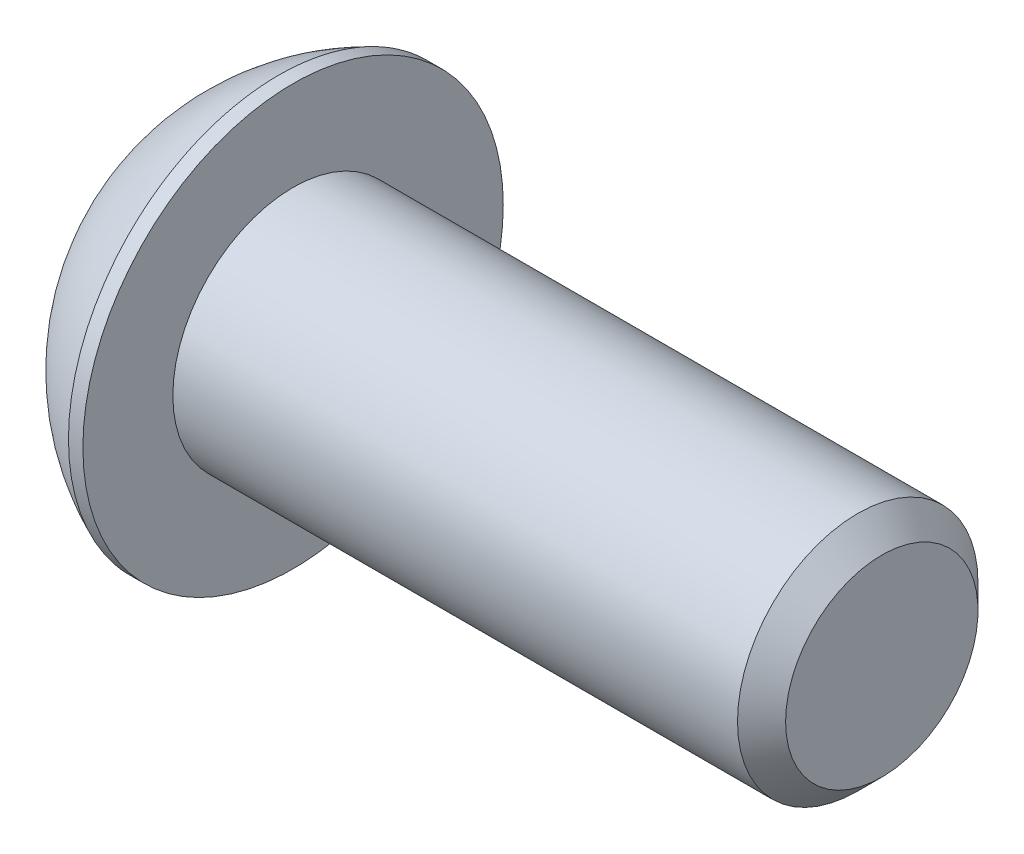
ISO-10303-21;
HEADER;
FILE_DESCRIPTION(('STEP AP214'),'2;1');
FILE_NAME('part.step','',(''),(''),'','','');
FILE_SCHEMA(('AUTOMOTIVE_DESIGN { 1 0 10303 214 1 1 1 1 }'));
ENDSEC;
DATA;
#1=APPLICATION_CONTEXT('core data for automotive mechanical design processes');
#2=APPLICATION_PROTOCOL_DEFINITION('international standard','automotive_design',2000,#1);
#3=PRODUCT_CONTEXT('',#1,'mechanical');
#4=PRODUCT('Part','Part','',(#3));
#5=PRODUCT_RELATED_PRODUCT_CATEGORY('part','',(#4));
#6=PRODUCT_DEFINITION_FORMATION('','',#4);
#7=PRODUCT_DEFINITION_CONTEXT('part definition',#1,'design');
#8=PRODUCT_DEFINITION('design','',#6,#7);
#9=PRODUCT_DEFINITION_SHAPE('','',#8);
#10=(LENGTH_UNIT() NAMED_UNIT(*) SI_UNIT(.MILLI.,.METRE.));
#11=(NAMED_UNIT(*) PLANE_ANGLE_UNIT() SI_UNIT($,.RADIAN.));
#12=(NAMED_UNIT(*) SI_UNIT($,.STERADIAN.) SOLID_ANGLE_UNIT());
#13=UNCERTAINTY_MEASURE_WITH_UNIT(LENGTH_MEASURE(1.E-05),#10,'distance_accuracy_value','');
#14=(GEOMETRIC_REPRESENTATION_CONTEXT(3) GLOBAL_UNCERTAINTY_ASSIGNED_CONTEXT((#13)) GLOBAL_UNIT_ASSIGNED_CONTEXT((#10,
#11,#12)) REPRESENTATION_CONTEXT('',''));
#15=CARTESIAN_POINT('',(0.,0.,0.));
#16=DIRECTION('',(0.,0.,1.));
#17=DIRECTION('',(1.,0.,0.));
#18=AXIS2_PLACEMENT_3D('',#15,#16,#17);
#19=CARTESIAN_POINT('',(1.32080000000034,0.,0.));
#20=DIRECTION('',(-1.,0.,0.));
#21=DIRECTION('',(0.,0.,1.));
#22=AXIS2_PLACEMENT_3D('',#19,#20,#21);
#23=CONICAL_SURFACE('',#22,1.1937999999998,1.04719755119608);
#24=CARTESIAN_POINT('',(2.01004075135902,0.,-4.44089209850063E-13));
#25=VERTEX_POINT('',#24);
#26=VERTEX_LOOP('',#25);
#27=FACE_BOUND('',#26,.T.);
#28=CARTESIAN_POINT('',(1.32080000000009,0.,0.));
#29=DIRECTION('',(-1.,0.,0.));
#30=DIRECTION('',(0.,0.,1.));
#31=AXIS2_PLACEMENT_3D('',#28,#29,#30);
#32=CIRCLE('',#31,1.19380000000024);
#33=CARTESIAN_POINT('',(1.32080000000009,0.,1.19380000000024));
#34=VERTEX_POINT('',#33);
#35=EDGE_CURVE('E19',#34,#34,#32,.T.);
#36=ORIENTED_EDGE('',*,*,#35,.T.);
#37=EDGE_LOOP('',(#36));
#38=FACE_BOUND('',#37,.T.);
#39=ADVANCED_FACE('F16',(#27,#38),#23,.F.);
#40=CARTESIAN_POINT('',(1.3208,-2.29135888084633,0.));
#41=DIRECTION('',(1.,0.,0.));
#42=DIRECTION('',(0.,0.,-1.));
#43=AXIS2_PLACEMENT_3D('',#40,#41,#42);
#44=PLANE('',#43);
#45=DIRECTION('',(0.,1.,0.));
#46=VECTOR('',#45,1.);
#47=CARTESIAN_POINT('',(1.3208,-1.14567944042316,1.984375));
#48=LINE('',#47,#46);
#49=CARTESIAN_POINT('',(1.3208,1.14567944042316,1.984375));
#50=VERTEX_POINT('',#49);
#51=CARTESIAN_POINT('',(1.3208,-1.14567944042316,1.984375));
#52=VERTEX_POINT('',#51);
#53=EDGE_CURVE('E68',#50,#52,#48,.F.);
#54=ORIENTED_EDGE('',*,*,#53,.F.);
#55=DIRECTION('',(0.,0.5,-0.866025403784439));
#56=VECTOR('',#55,1.);
#57=CARTESIAN_POINT('',(1.3208,1.14567944042316,1.984375));
#58=LINE('',#57,#56);
#59=CARTESIAN_POINT('',(1.3208,2.29135888084633,0.));
#60=VERTEX_POINT('',#59);
#61=EDGE_CURVE('E291',#60,#50,#58,.F.);
#62=ORIENTED_EDGE('',*,*,#61,.F.);
#63=DIRECTION('',(0.,-0.5,-0.866025403784439));
#64=VECTOR('',#63,1.);
#65=CARTESIAN_POINT('',(1.3208,2.29135888084633,0.));
#66=LINE('',#65,#64);
#67=CARTESIAN_POINT('',(1.3208,1.14567944042316,-1.984375));
#68=VERTEX_POINT('',#67);
#69=EDGE_CURVE('E295',#68,#60,#66,.F.);
#70=ORIENTED_EDGE('',*,*,#69,.F.);
#71=DIRECTION('',(0.,1.,0.));
#72=VECTOR('',#71,1.);
#73=CARTESIAN_POINT('',(1.3208,1.14567944042316,-1.984375));
#74=LINE('',#73,#72);
#75=CARTESIAN_POINT('',(1.3208,-1.14567944042316,-1.984375));
#76=VERTEX_POINT('',#75);
#77=EDGE_CURVE('E300',#76,#68,#74,.T.);
#78=ORIENTED_EDGE('',*,*,#77,.F.);
#79=DIRECTION('',(0.,-0.500000000000001,0.866025403784438));
#80=VECTOR('',#79,1.);
#81=CARTESIAN_POINT('',(1.3208,-1.14567944042316,-1.984375));
#82=LINE('',#81,#80);
#83=CARTESIAN_POINT('',(1.3208,-2.29135888084633,0.));
#84=VERTEX_POINT('',#83);
#85=EDGE_CURVE('E305',#84,#76,#82,.F.);
#86=ORIENTED_EDGE('',*,*,#85,.F.);
#87=DIRECTION('',(0.,0.500000000000001,0.866025403784438));
#88=VECTOR('',#87,1.);
#89=CARTESIAN_POINT('',(1.3208,-2.29135888084633,0.));
#90=LINE('',#89,#88);
#91=EDGE_CURVE('E81',#52,#84,#90,.F.);
#92=ORIENTED_EDGE('',*,*,#91,.F.);
#93=EDGE_LOOP('',(#54,#62,#70,#78,#86,#92));
#94=FACE_BOUND('',#93,.T.);
#95=ORIENTED_EDGE('',*,*,#35,.F.);
#96=EDGE_LOOP('',(#95));
#97=FACE_BOUND('',#96,.T.);
#98=ADVANCED_FACE('F74',(#94,#97),#44,.F.);
#99=CARTESIAN_POINT('',(1.3208,-1.14567944042316,1.984375));
#100=DIRECTION('',(0.,0.,-1.));
#101=DIRECTION('',(0.,1.,0.));
#102=AXIS2_PLACEMENT_3D('',#99,#100,#101);
#103=PLANE('',#102);
#104=ORIENTED_EDGE('',*,*,#53,.T.);
#105=DIRECTION('',(1.,0.,0.));
#106=VECTOR('',#105,1.);
#107=CARTESIAN_POINT('',(1.3208,-1.14567944042316,1.984375));
#108=LINE('',#107,#106);
#109=CARTESIAN_POINT('',(0.,-1.14567944042316,1.984375));
#110=VERTEX_POINT('',#109);
#111=EDGE_CURVE('E78',#110,#52,#108,.T.);
#112=ORIENTED_EDGE('',*,*,#111,.F.);
#113=DIRECTION('',(0.,1.,0.));
#114=VECTOR('',#113,1.);
#115=CARTESIAN_POINT('',(0.,0.,1.984375));
#116=LINE('',#115,#114);
#117=CARTESIAN_POINT('',(0.,1.14567944042316,1.984375));
#118=VERTEX_POINT('',#117);
#119=EDGE_CURVE('E285',#118,#110,#116,.F.);
#120=ORIENTED_EDGE('',*,*,#119,.F.);
#121=DIRECTION('',(1.,0.,0.));
#122=VECTOR('',#121,1.);
#123=CARTESIAN_POINT('',(1.3208,1.14567944042316,1.984375));
#124=LINE('',#123,#122);
#125=EDGE_CURVE('E288',#50,#118,#124,.F.);
#126=ORIENTED_EDGE('',*,*,#125,.F.);
#127=EDGE_LOOP('',(#104,#112,#120,#126));
#128=FACE_BOUND('',#127,.T.);
#129=ADVANCED_FACE('F127',(#128),#103,.T.);
#130=CARTESIAN_POINT('',(1.3208,-2.29135888084633,0.));
#131=DIRECTION('',(0.,0.866025403784438,-0.500000000000001));
#132=DIRECTION('',(0.,0.500000000000001,0.866025403784438));
#133=AXIS2_PLACEMENT_3D('',#130,#131,#132);
#134=PLANE('',#133);
#135=ORIENTED_EDGE('',*,*,#91,.T.);
#136=DIRECTION('',(1.,0.,0.));
#137=VECTOR('',#136,1.);
#138=CARTESIAN_POINT('',(1.3208,-2.29135888084633,0.));
#139=LINE('',#138,#137);
#140=CARTESIAN_POINT('',(0.,-2.29135888084633,0.));
#141=VERTEX_POINT('',#140);
#142=EDGE_CURVE('E307',#141,#84,#139,.T.);
#143=ORIENTED_EDGE('',*,*,#142,.F.);
#144=DIRECTION('',(0.,-0.500000000000001,-0.866025403784438));
#145=VECTOR('',#144,1.);
#146=CARTESIAN_POINT('',(0.,-1.14567944042316,1.984375));
#147=LINE('',#146,#145);
#148=EDGE_CURVE('E282',#110,#141,#147,.T.);
#149=ORIENTED_EDGE('',*,*,#148,.F.);
#150=ORIENTED_EDGE('',*,*,#111,.T.);
#151=EDGE_LOOP('',(#135,#143,#149,#150));
#152=FACE_BOUND('',#151,.T.);
#153=ADVANCED_FACE('F123',(#152),#134,.T.);
#154=CARTESIAN_POINT('',(1.3208,-1.14567944042316,-1.984375));
#155=DIRECTION('',(0.,0.866025403784438,0.500000000000001));
#156=DIRECTION('',(0.,-0.500000000000001,0.866025403784438));
#157=AXIS2_PLACEMENT_3D('',#154,#155,#156);
#158=PLANE('',#157);
#159=ORIENTED_EDGE('',*,*,#85,.T.);
#160=DIRECTION('',(1.,0.,0.));
#161=VECTOR('',#160,1.);
#162=CARTESIAN_POINT('',(1.3208,-1.14567944042316,-1.984375));
#163=LINE('',#162,#161);
#164=CARTESIAN_POINT('',(0.,-1.14567944042316,-1.984375));
#165=VERTEX_POINT('',#164);
#166=EDGE_CURVE('E302',#165,#76,#163,.T.);
#167=ORIENTED_EDGE('',*,*,#166,.F.);
#168=DIRECTION('',(0.,0.500000000000001,-0.866025403784438));
#169=VECTOR('',#168,1.);
#170=CARTESIAN_POINT('',(0.,-2.29135888084633,0.));
#171=LINE('',#170,#169);
#172=EDGE_CURVE('E279',#141,#165,#171,.T.);
#173=ORIENTED_EDGE('',*,*,#172,.F.);
#174=ORIENTED_EDGE('',*,*,#142,.T.);
#175=EDGE_LOOP('',(#159,#167,#173,#174));
#176=FACE_BOUND('',#175,.T.);
#177=ADVANCED_FACE('F119',(#176),#158,.T.);
#178=CARTESIAN_POINT('',(1.3208,1.14567944042316,-1.984375));
#179=DIRECTION('',(0.,0.,1.));
#180=DIRECTION('',(1.,0.,0.));
#181=AXIS2_PLACEMENT_3D('',#178,#179,#180);
#182=PLANE('',#181);
#183=ORIENTED_EDGE('',*,*,#77,.T.);
#184=DIRECTION('',(1.,0.,0.));
#185=VECTOR('',#184,1.);
#186=CARTESIAN_POINT('',(1.3208,1.14567944042316,-1.984375));
#187=LINE('',#186,#185);
#188=CARTESIAN_POINT('',(0.,1.14567944042316,-1.984375));
#189=VERTEX_POINT('',#188);
#190=EDGE_CURVE('E297',#189,#68,#187,.T.);
#191=ORIENTED_EDGE('',*,*,#190,.F.);
#192=DIRECTION('',(0.,1.,0.));
#193=VECTOR('',#192,1.);
#194=CARTESIAN_POINT('',(0.,0.,-1.984375));
#195=LINE('',#194,#193);
#196=EDGE_CURVE('E276',#165,#189,#195,.T.);
#197=ORIENTED_EDGE('',*,*,#196,.F.);
#198=ORIENTED_EDGE('',*,*,#166,.T.);
#199=EDGE_LOOP('',(#183,#191,#197,#198));
#200=FACE_BOUND('',#199,.T.);
#201=ADVANCED_FACE('F116',(#200),#182,.T.);
#202=CARTESIAN_POINT('',(1.3208,2.29135888084633,0.));
#203=DIRECTION('',(0.,-0.866025403784439,0.5));
#204=DIRECTION('',(0.,-0.5,-0.866025403784439));
#205=AXIS2_PLACEMENT_3D('',#202,#203,#204);
#206=PLANE('',#205);
#207=ORIENTED_EDGE('',*,*,#69,.T.);
#208=DIRECTION('',(1.,0.,0.));
#209=VECTOR('',#208,1.);
#210=CARTESIAN_POINT('',(1.3208,2.29135888084633,0.));
#211=LINE('',#210,#209);
#212=CARTESIAN_POINT('',(0.,2.29135888084633,0.));
#213=VERTEX_POINT('',#212);
#214=EDGE_CURVE('E34',#213,#60,#211,.T.);
#215=ORIENTED_EDGE('',*,*,#214,.F.);
#216=DIRECTION('',(0.,0.5,0.866025403784439));
#217=VECTOR('',#216,1.);
#218=CARTESIAN_POINT('',(0.,1.14567944042316,-1.984375));
#219=LINE('',#218,#217);
#220=EDGE_CURVE('E273',#189,#213,#219,.T.);
#221=ORIENTED_EDGE('',*,*,#220,.F.);
#222=ORIENTED_EDGE('',*,*,#190,.T.);
#223=EDGE_LOOP('',(#207,#215,#221,#222));
#224=FACE_BOUND('',#223,.T.);
#225=ADVANCED_FACE('F112',(#224),#206,.T.);
#226=CARTESIAN_POINT('',(1.3208,1.14567944042316,1.984375));
#227=DIRECTION('',(0.,-0.866025403784439,-0.5));
#228=DIRECTION('',(0.,0.5,-0.866025403784439));
#229=AXIS2_PLACEMENT_3D('',#226,#227,#228);
#230=PLANE('',#229);
#231=ORIENTED_EDGE('',*,*,#61,.T.);
#232=ORIENTED_EDGE('',*,*,#125,.T.);
#233=DIRECTION('',(0.,-0.5,0.866025403784438));
#234=VECTOR('',#233,1.);
#235=CARTESIAN_POINT('',(0.,2.29135888084633,0.));
#236=LINE('',#235,#234);
#237=EDGE_CURVE('E99',#213,#118,#236,.T.);
#238=ORIENTED_EDGE('',*,*,#237,.F.);
#239=ORIENTED_EDGE('',*,*,#214,.T.);
#240=EDGE_LOOP('',(#231,#232,#238,#239));
#241=FACE_BOUND('',#240,.T.);
#242=ADVANCED_FACE('F108',(#241),#230,.T.);
#243=CARTESIAN_POINT('',(0.,0.,0.));
#244=DIRECTION('',(-1.,0.,0.));
#245=DIRECTION('',(0.,0.,1.));
#246=AXIS2_PLACEMENT_3D('',#243,#244,#245);
#247=PLANE('',#246);
#248=ORIENTED_EDGE('',*,*,#220,.T.);
#249=ORIENTED_EDGE('',*,*,#237,.T.);
#250=ORIENTED_EDGE('',*,*,#119,.T.);
#251=ORIENTED_EDGE('',*,*,#148,.T.);
#252=ORIENTED_EDGE('',*,*,#172,.T.);
#253=ORIENTED_EDGE('',*,*,#196,.T.);
#254=EDGE_LOOP('',(#248,#249,#250,#251,#252,#253));
#255=FACE_BOUND('',#254,.T.);
#256=CARTESIAN_POINT('',(0.,2.77495,0.));
#257=CARTESIAN_POINT('',(0.,2.77494953309947,0.0779118937523459));
#258=CARTESIAN_POINT('',(0.,2.77166578388025,0.15583810591977));
#259=CARTESIAN_POINT('',(0.,2.75855213600204,0.311152012455904));
#260=CARTESIAN_POINT('',(0.,2.74872030471467,0.388539541019556));
#261=CARTESIAN_POINT('',(0.,2.72255472645676,0.542341518735717));
#262=CARTESIAN_POINT('',(-2.70414110576258E-13,2.70621065843663,0.618754223567578));
#263=CARTESIAN_POINT('',(2.71501725221868E-13,2.66713326915777,0.769973634286023));
#264=CARTESIAN_POINT('',(1.01274952524446E-12,2.64439476297869,0.844778983646282));
#265=CARTESIAN_POINT('',(1.81909959813207E-12,2.56690195943351,1.06566239301792));
#266=CARTESIAN_POINT('',(4.77081687541822E-13,2.50280672569928,1.20857954243987));
#267=CARTESIAN_POINT('',(-4.76232447128612E-13,2.35149826934097,1.48160874561538));
#268=CARTESIAN_POINT('',(0.,2.26428416790397,1.61172031233499));
#269=CARTESIAN_POINT('',(0.,2.1181093928834,1.79445660654268));
#270=CARTESIAN_POINT('',(0.,2.06678693791626,1.85333128513996));
#271=CARTESIAN_POINT('',(0.,1.95940522984449,1.96650727912792));
#272=CARTESIAN_POINT('',(0.,1.90335059143535,2.02081294920044));
#273=CARTESIAN_POINT('',(0.,1.78683891013963,2.12453280878582));
#274=CARTESIAN_POINT('',(0.,1.72637988450322,2.1739447713554));
#275=CARTESIAN_POINT('',(0.,1.60151968865711,2.26750481692908));
#276=CARTESIAN_POINT('',(0.,1.53711760864537,2.31165167810847));
#277=CARTESIAN_POINT('',(0.,1.33869902291632,2.43567242603944));
#278=CARTESIAN_POINT('',(0.,1.19934704110695,2.507235886628));
#279=CARTESIAN_POINT('',(0.,0.910681609121881,2.62590828672821));
#280=CARTESIAN_POINT('',(0.,0.761368265357398,2.67301748742278));
#281=CARTESIAN_POINT('',(0.,0.456932649466623,2.74151230664007));
#282=CARTESIAN_POINT('',(0.,0.301810346322584,2.76289778778721));
#283=CARTESIAN_POINT('',(0.,-0.00982263870895171,2.77931595661156));
#284=CARTESIAN_POINT('',(0.,-0.166333320596448,2.77434864428877));
#285=CARTESIAN_POINT('',(0.,-0.476280836814452,2.73822217653073));
#286=CARTESIAN_POINT('',(0.,-0.629717687555985,2.70706316096981));
#287=CARTESIAN_POINT('',(0.,-0.929254830044274,2.61937980771149));
#288=CARTESIAN_POINT('',(0.,-1.0753550434132,2.56285519909568));
#289=CARTESIAN_POINT('',(0.,-1.28570692598579,2.46037024128109));
#290=CARTESIAN_POINT('',(0.,-1.35439130022287,2.42323494812896));
#291=CARTESIAN_POINT('',(0.,-1.488391287199,2.34331277270256));
#292=CARTESIAN_POINT('',(0.,-1.55370767631787,2.30052720108831));
#293=CARTESIAN_POINT('',(0.,-1.68047292776594,2.20962421887055));
#294=CARTESIAN_POINT('',(0.,-1.7419235278682,2.16150923122348));
#295=CARTESIAN_POINT('',(0.,-1.86060297067992,2.06024311301283));
#296=CARTESIAN_POINT('',(0.,-1.91782768181715,2.0070871669763));
#297=CARTESIAN_POINT('',(0.,-2.08239462196651,1.8407220856554));
#298=CARTESIAN_POINT('',(0.,-2.18279764272601,1.72049499758422));
#299=CARTESIAN_POINT('',(0.,-2.36195754944063,1.46487629213018));
#300=CARTESIAN_POINT('',(0.,-2.44071525816758,1.32948525142807));
#301=CARTESIAN_POINT('',(0.,-2.54098882695274,1.11796734074395));
#302=CARTESIAN_POINT('',(0.,-2.57146177392727,1.04596540008347));
#303=CARTESIAN_POINT('',(0.,-2.62621251108999,0.899689259475764));
#304=CARTESIAN_POINT('',(0.,-2.65049531495563,0.825416953360952));
#305=CARTESIAN_POINT('',(0.,-2.69267708798766,0.675215808695207));
#306=CARTESIAN_POINT('',(0.,-2.71058613777937,0.599289789313092));
#307=CARTESIAN_POINT('',(0.,-2.73994710360127,0.446213628496932));
#308=CARTESIAN_POINT('',(0.,-2.75140092413871,0.369063855024788));
#309=CARTESIAN_POINT('',(0.,-2.76470470685522,0.24316208817343));
#310=CARTESIAN_POINT('',(0.,-2.76854547596618,0.194611672428577));
#311=CARTESIAN_POINT('',(0.,-2.77366826843264,0.0973760351839812));
#312=CARTESIAN_POINT('',(0.,-2.77495029178814,0.0486908136842395));
#313=CARTESIAN_POINT('',(0.,-2.77494953309947,-0.0779118937523475));
#314=CARTESIAN_POINT('',(0.,-2.77166578388025,-0.155838105919772));
#315=CARTESIAN_POINT('',(0.,-2.75855213600204,-0.311152012455906));
#316=CARTESIAN_POINT('',(0.,-2.74872030471467,-0.388539541019558));
#317=CARTESIAN_POINT('',(0.,-2.72255472645677,-0.542341518735719));
#318=CARTESIAN_POINT('',(-2.70149297926331E-13,-2.70621065843663,-0.61875422356758));
#319=CARTESIAN_POINT('',(2.712366972268E-13,-2.66713326915777,-0.769973634286024));
#320=CARTESIAN_POINT('',(1.0114146773846E-12,-2.64439476297869,-0.844778983646283));
#321=CARTESIAN_POINT('',(1.81656702958366E-12,-2.5669019594335,-1.06566239301792));
#322=CARTESIAN_POINT('',(4.7641829195856E-13,-2.50280672569928,-1.20857954243988));
#323=CARTESIAN_POINT('',(-4.75569026324205E-13,-2.35149826934097,-1.48160874561538));
#324=CARTESIAN_POINT('',(0.,-2.26428416790396,-1.61172031233499));
#325=CARTESIAN_POINT('',(0.,-2.1181093928834,-1.79445660654268));
#326=CARTESIAN_POINT('',(0.,-2.06678693791626,-1.85333128513997));
#327=CARTESIAN_POINT('',(0.,-1.95940522984449,-1.96650727912792));
#328=CARTESIAN_POINT('',(0.,-1.90335059143535,-2.02081294920044));
#329=CARTESIAN_POINT('',(0.,-1.78683891013963,-2.12453280878582));
#330=CARTESIAN_POINT('',(0.,-1.72637988450322,-2.1739447713554));
#331=CARTESIAN_POINT('',(0.,-1.60151968865711,-2.26750481692908));
#332=CARTESIAN_POINT('',(0.,-1.53711760864537,-2.31165167810847));
#333=CARTESIAN_POINT('',(0.,-1.33869902291632,-2.43567242603944));
#334=CARTESIAN_POINT('',(0.,-1.19934704110695,-2.507235886628));
#335=CARTESIAN_POINT('',(0.,-0.91068160912188,-2.62590828672821));
#336=CARTESIAN_POINT('',(0.,-0.761368265357396,-2.67301748742278));
#337=CARTESIAN_POINT('',(0.,-0.456932649466621,-2.74151230664007));
#338=CARTESIAN_POINT('',(0.,-0.301810346322582,-2.76289778778721));
#339=CARTESIAN_POINT('',(0.,0.00982263870895353,-2.77931595661156));
#340=CARTESIAN_POINT('',(0.,0.16633332059645,-2.77434864428876));
#341=CARTESIAN_POINT('',(0.,0.476280836814454,-2.73822217653073));
#342=CARTESIAN_POINT('',(0.,0.629717687555987,-2.70706316096981));
#343=CARTESIAN_POINT('',(0.,0.929254830044276,-2.6193798077115));
#344=CARTESIAN_POINT('',(0.,1.0753550434132,-2.56285519909568));
#345=CARTESIAN_POINT('',(0.,1.28570692598579,-2.46037024128109));
#346=CARTESIAN_POINT('',(0.,1.35439130022287,-2.42323494812896));
#347=CARTESIAN_POINT('',(0.,1.488391287199,-2.34331277270256));
#348=CARTESIAN_POINT('',(0.,1.55370767631787,-2.30052720108831));
#349=CARTESIAN_POINT('',(0.,1.68047292776594,-2.20962421887055));
#350=CARTESIAN_POINT('',(0.,1.7419235278682,-2.16150923122348));
#351=CARTESIAN_POINT('',(0.,1.86060297067992,-2.06024311301282));
#352=CARTESIAN_POINT('',(0.,1.91782768181716,-2.0070871669763));
#353=CARTESIAN_POINT('',(0.,2.08239462196651,-1.8407220856554));
#354=CARTESIAN_POINT('',(0.,2.18279764272601,-1.72049499758422));
#355=CARTESIAN_POINT('',(0.,2.36195754944063,-1.46487629213018));
#356=CARTESIAN_POINT('',(0.,2.44071525816757,-1.32948525142807));
#357=CARTESIAN_POINT('',(0.,2.54098882695273,-1.11796734074395));
#358=CARTESIAN_POINT('',(0.,2.57146177392727,-1.04596540008347));
#359=CARTESIAN_POINT('',(0.,2.62621251108999,-0.899689259475765));
#360=CARTESIAN_POINT('',(0.,2.65049531495563,-0.825416953360953));
#361=CARTESIAN_POINT('',(0.,2.69267708798766,-0.675215808695207));
#362=CARTESIAN_POINT('',(0.,2.71058613777936,-0.599289789313092));
#363=CARTESIAN_POINT('',(0.,2.73994710360127,-0.446213628496932));
#364=CARTESIAN_POINT('',(0.,2.75140092413871,-0.369063855024789));
#365=CARTESIAN_POINT('',(0.,2.76470470685522,-0.243162088173432));
#366=CARTESIAN_POINT('',(0.,2.76854547596618,-0.194611672428578));
#367=CARTESIAN_POINT('',(0.,2.77366826843264,-0.0973760351839823));
#368=CARTESIAN_POINT('',(0.,2.77495029178814,-0.0486908136842408));
#369=CARTESIAN_POINT('',(0.,2.77495,0.));
#370=B_SPLINE_CURVE_WITH_KNOTS('',3,(#256,#257,#258,#259,#260,#261,#262,#263,#264,#265,#266,
#267,#268,#269,#270,#271,#272,#273,#274,#275,#276,#277,#278,#279,#280,#281,#282,#283,#284,#285,
#286,#287,#288,#289,#290,#291,#292,#293,#294,#295,#296,#297,#298,#299,#300,#301,#302,#303,#304,
#305,#306,#307,#308,#309,#310,#311,#312,#313,#314,#315,#316,#317,#318,#319,#320,#321,#322,#323,
#324,#325,#326,#327,#328,#329,#330,#331,#332,#333,#334,#335,#336,#337,#338,#339,#340,#341,#342,
#343,#344,#345,#346,#347,#348,#349,#350,#351,#352,#353,#354,#355,#356,#357,#358,#359,#360,#361,
#362,#363,#364,#365,#366,#367,#368,#369),.UNSPECIFIED.,.T.,.F.,(4,2,2,2,2,2,2,2,2,2,2,2,2,2,2,2,
2,2,2,2,2,2,2,2,2,2,2,2,2,2,2,2,2,2,2,2,2,2,2,2,2,2,2,2,2,2,2,2,2,2,2,2,2,2,2,2,4),(0.,
0.233690856748162,0.467450716578751,0.701582538521471,0.935904756015414,1.40343220467667,
1.87097742791502,2.10505636898837,2.33890962270652,2.57286880998746,2.80688218486306,
3.27442101763127,3.74195485676357,4.20949119271389,4.67702752866417,5.14456136779641,
5.61210020056468,5.84611357544033,6.08007276272136,6.31392601643949,6.54800495751273,
7.01555018075072,7.48307762941212,7.71739984690652,7.95153166884955,8.18529152868023,
8.41898238542855,8.56502681353347,8.71107124163843,8.94476209838659,9.17852195821718,
9.4126537801599,9.64697599765384,10.1145034463151,10.5820486695534,10.8161276106268,
11.0499808643449,11.2839400516259,11.5179534265015,11.9854922592697,12.453026098402,
12.9205624343523,13.3880987703026,13.8556326094348,14.3231714422031,14.5571848170788,
14.7911440043598,15.0249972580779,15.2590761991512,15.7266214223891,16.1941488710506,
16.4284710885449,16.662602910488,16.8963627703186,17.130053627067,17.2760980551719,
17.4221424832769),.UNSPECIFIED.);
#371=CARTESIAN_POINT('',(0.,2.77495,0.));
#372=VERTEX_POINT('',#371);
#373=EDGE_CURVE('E93',#372,#372,#370,.T.);
#374=ORIENTED_EDGE('',*,*,#373,.F.);
#375=EDGE_LOOP('',(#374));
#376=FACE_BOUND('',#375,.T.);
#377=ADVANCED_FACE('F104',(#255,#376),#247,.T.);
#378=CARTESIAN_POINT('',(5.37260881410256,0.,0.));
#379=DIRECTION('',(0.,1.,0.));
#380=DIRECTION('',(1.,0.,0.));
#381=AXIS2_PLACEMENT_3D('',#378,#379,#380);
#382=SPHERICAL_SURFACE('',#381,6.04692260342999);
#383=CARTESIAN_POINT('',(2.9718,0.,0.));
#384=DIRECTION('',(-1.,0.,0.));
#385=DIRECTION('',(0.,0.,1.));
#386=AXIS2_PLACEMENT_3D('',#383,#384,#385);
#387=CIRCLE('',#386,5.5499);
#388=CARTESIAN_POINT('',(2.9718,0.,5.5499));
#389=VERTEX_POINT('',#388);
#390=EDGE_CURVE('E91',#389,#389,#387,.F.);
#391=ORIENTED_EDGE('',*,*,#390,.F.);
#392=EDGE_LOOP('',(#391));
#393=FACE_BOUND('',#392,.T.);
#394=ORIENTED_EDGE('',*,*,#373,.T.);
#395=EDGE_LOOP('',(#394));
#396=FACE_BOUND('',#395,.T.);
#397=ADVANCED_FACE('F100',(#393,#396),#382,.T.);
#398=CARTESIAN_POINT('',(18.8976,0.,0.));
#399=DIRECTION('',(-1.,0.,0.));
#400=DIRECTION('',(0.,0.,1.));
#401=AXIS2_PLACEMENT_3D('',#398,#399,#400);
#402=PLANE('',#401);
#403=CARTESIAN_POINT('',(18.8976000000025,0.,0.));
#404=DIRECTION('',(-1.,0.,0.));
#405=DIRECTION('',(0.,0.,1.));
#406=AXIS2_PLACEMENT_3D('',#403,#404,#405);
#407=CIRCLE('',#406,2.54000000001042);
#408=CARTESIAN_POINT('',(18.8976000000025,0.,2.54000000001042));
#409=VERTEX_POINT('',#408);
#410=EDGE_CURVE('E88',#409,#409,#407,.T.);
#411=ORIENTED_EDGE('',*,*,#410,.F.);
#412=EDGE_LOOP('',(#411));
#413=FACE_BOUND('',#412,.T.);
#414=ADVANCED_FACE('F154',(#413),#402,.F.);
#415=CARTESIAN_POINT('',(0.,0.,0.));
#416=DIRECTION('',(-1.,0.,0.));
#417=DIRECTION('',(0.,0.,1.));
#418=AXIS2_PLACEMENT_3D('',#415,#416,#417);
#419=CYLINDRICAL_SURFACE('',#418,5.5499);
#420=ORIENTED_EDGE('',*,*,#390,.T.);
#421=EDGE_LOOP('',(#420));
#422=FACE_BOUND('',#421,.T.);
#423=CARTESIAN_POINT('',(3.3528,0.,0.));
#424=DIRECTION('',(-1.,0.,0.));
#425=DIRECTION('',(0.,0.,1.));
#426=AXIS2_PLACEMENT_3D('',#423,#424,#425);
#427=CIRCLE('',#426,5.5499);
#428=CARTESIAN_POINT('',(3.3528,0.,5.5499));
#429=VERTEX_POINT('',#428);
#430=EDGE_CURVE('E85',#429,#429,#427,.T.);
#431=ORIENTED_EDGE('',*,*,#430,.T.);
#432=EDGE_LOOP('',(#431));
#433=FACE_BOUND('',#432,.T.);
#434=ADVANCED_FACE('F151',(#422,#433),#419,.T.);
#435=CARTESIAN_POINT('',(18.2626000001278,0.,0.));
#436=DIRECTION('',(-1.,0.,0.));
#437=DIRECTION('',(0.,0.,1.));
#438=AXIS2_PLACEMENT_3D('',#435,#436,#437);
#439=CONICAL_SURFACE('',#438,3.17499999988513,0.785398163397448);
#440=CARTESIAN_POINT('',(18.2626,0.,0.));
#441=DIRECTION('',(-1.,0.,0.));
#442=DIRECTION('',(0.,0.,1.));
#443=AXIS2_PLACEMENT_3D('',#440,#441,#442);
#444=CIRCLE('',#443,3.175);
#445=CARTESIAN_POINT('',(18.2626,0.,3.175));
#446=VERTEX_POINT('',#445);
#447=EDGE_CURVE('E25',#446,#446,#444,.T.);
#448=ORIENTED_EDGE('',*,*,#447,.F.);
#449=EDGE_LOOP('',(#448));
#450=FACE_BOUND('',#449,.T.);
#451=ORIENTED_EDGE('',*,*,#410,.T.);
#452=EDGE_LOOP('',(#451));
#453=FACE_BOUND('',#452,.T.);
#454=ADVANCED_FACE('F144',(#450,#453),#439,.T.);
#455=CARTESIAN_POINT('',(3.3528,3.175,0.));
#456=DIRECTION('',(-1.,0.,0.));
#457=DIRECTION('',(0.,0.,1.));
#458=AXIS2_PLACEMENT_3D('',#455,#456,#457);
#459=PLANE('',#458);
#460=CARTESIAN_POINT('',(3.3528,0.,0.));
#461=DIRECTION('',(-1.,0.,0.));
#462=DIRECTION('',(0.,0.,1.));
#463=AXIS2_PLACEMENT_3D('',#460,#461,#462);
#464=CIRCLE('',#463,3.175);
#465=CARTESIAN_POINT('',(3.3528,0.,3.175));
#466=VERTEX_POINT('',#465);
#467=EDGE_CURVE('E11',#466,#466,#464,.F.);
#468=ORIENTED_EDGE('',*,*,#467,.F.);
#469=EDGE_LOOP('',(#468));
#470=FACE_BOUND('',#469,.T.);
#471=ORIENTED_EDGE('',*,*,#430,.F.);
#472=EDGE_LOOP('',(#471));
#473=FACE_BOUND('',#472,.T.);
#474=ADVANCED_FACE('F138',(#470,#473),#459,.F.);
#475=CARTESIAN_POINT('',(0.,0.,0.));
#476=DIRECTION('',(-1.,0.,0.));
#477=DIRECTION('',(0.,0.,1.));
#478=AXIS2_PLACEMENT_3D('',#475,#476,#477);
#479=CYLINDRICAL_SURFACE('',#478,3.175);
#480=ORIENTED_EDGE('',*,*,#467,.T.);
#481=EDGE_LOOP('',(#480));
#482=FACE_BOUND('',#481,.T.);
#483=ORIENTED_EDGE('',*,*,#447,.T.);
#484=EDGE_LOOP('',(#483));
#485=FACE_BOUND('',#484,.T.);
#486=ADVANCED_FACE('F136',(#482,#485),#479,.T.);
#487=CLOSED_SHELL('',(#39,#98,#129,#153,#177,#201,#225,#242,#377,#397,#414,#434,#454,#474,#486));
#488=MANIFOLD_SOLID_BREP('B1',#487);
#489=ADVANCED_BREP_SHAPE_REPRESENTATION('',(#18,#488),#14);
#490=SHAPE_DEFINITION_REPRESENTATION(#9,#489);
ENDSEC;
END-ISO-10303-21;
